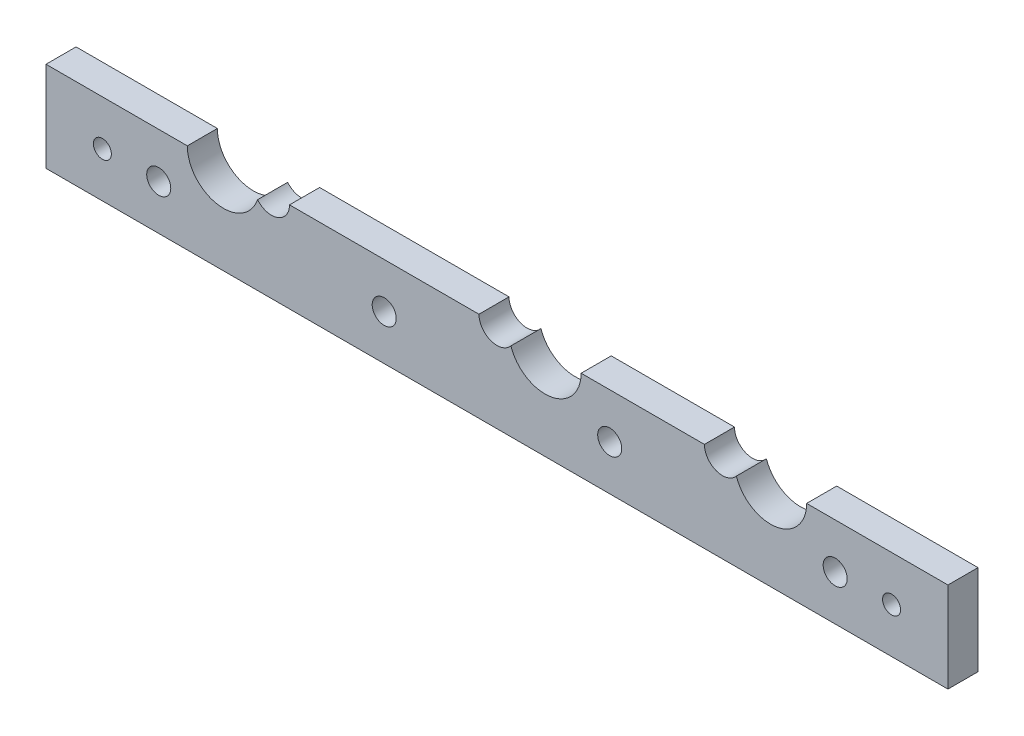
ISO-10303-21;
HEADER;
FILE_DESCRIPTION(('STEP AP214'),'2;1');
FILE_NAME('part.step','',(''),(''),'','','');
FILE_SCHEMA(('AUTOMOTIVE_DESIGN { 1 0 10303 214 1 1 1 1 }'));
ENDSEC;
DATA;
#1=APPLICATION_CONTEXT('core data for automotive mechanical design processes');
#2=APPLICATION_PROTOCOL_DEFINITION('international standard','automotive_design',2000,#1);
#3=PRODUCT_CONTEXT('',#1,'mechanical');
#4=PRODUCT('Part','Part','',(#3));
#5=PRODUCT_RELATED_PRODUCT_CATEGORY('part','',(#4));
#6=PRODUCT_DEFINITION_FORMATION('','',#4);
#7=PRODUCT_DEFINITION_CONTEXT('part definition',#1,'design');
#8=PRODUCT_DEFINITION('design','',#6,#7);
#9=PRODUCT_DEFINITION_SHAPE('','',#8);
#10=(LENGTH_UNIT() NAMED_UNIT(*) SI_UNIT(.MILLI.,.METRE.));
#11=(NAMED_UNIT(*) PLANE_ANGLE_UNIT() SI_UNIT($,.RADIAN.));
#12=(NAMED_UNIT(*) SI_UNIT($,.STERADIAN.) SOLID_ANGLE_UNIT());
#13=UNCERTAINTY_MEASURE_WITH_UNIT(LENGTH_MEASURE(1.E-05),#10,'distance_accuracy_value','');
#14=(GEOMETRIC_REPRESENTATION_CONTEXT(3) GLOBAL_UNCERTAINTY_ASSIGNED_CONTEXT((#13)) GLOBAL_UNIT_ASSIGNED_CONTEXT((#10,
#11,#12)) REPRESENTATION_CONTEXT('',''));
#15=CARTESIAN_POINT('',(0.,0.,0.));
#16=DIRECTION('',(0.,0.,1.));
#17=DIRECTION('',(1.,0.,0.));
#18=AXIS2_PLACEMENT_3D('',#15,#16,#17);
#19=CARTESIAN_POINT('',(-56.8107458055713,18.5530588779456,5.));
#20=DIRECTION('',(1.,0.,0.));
#21=DIRECTION('',(0.,1.,0.));
#22=AXIS2_PLACEMENT_3D('',#19,#20,#21);
#23=PLANE('',#22);
#24=DIRECTION('',(0.,0.,1.));
#25=VECTOR('',#24,1.);
#26=CARTESIAN_POINT('',(-56.8107458055713,3.55305887794556,-5.));
#27=LINE('',#26,#25);
#28=CARTESIAN_POINT('',(-56.8107458055713,3.55305887794556,0.));
#29=VERTEX_POINT('',#28);
#30=CARTESIAN_POINT('',(-56.8107458055713,3.55305887794556,5.));
#31=VERTEX_POINT('',#30);
#32=EDGE_CURVE('E216',#29,#31,#27,.T.);
#33=ORIENTED_EDGE('',*,*,#32,.F.);
#34=DIRECTION('',(0.,-1.,0.));
#35=VECTOR('',#34,1.);
#36=CARTESIAN_POINT('',(-56.8107458055713,18.5530588779456,0.));
#37=LINE('',#36,#35);
#38=CARTESIAN_POINT('',(-56.8107458055713,-11.4469411220544,0.));
#39=VERTEX_POINT('',#38);
#40=EDGE_CURVE('E162',#29,#39,#37,.T.);
#41=ORIENTED_EDGE('',*,*,#40,.T.);
#42=DIRECTION('',(0.,0.,-1.));
#43=VECTOR('',#42,1.);
#44=CARTESIAN_POINT('',(-56.8107458055713,-11.4469411220544,5.));
#45=LINE('',#44,#43);
#46=CARTESIAN_POINT('',(-56.8107458055713,-11.4469411220544,5.));
#47=VERTEX_POINT('',#46);
#48=EDGE_CURVE('E179',#47,#39,#45,.T.);
#49=ORIENTED_EDGE('',*,*,#48,.F.);
#50=DIRECTION('',(0.,-1.,0.));
#51=VECTOR('',#50,1.);
#52=CARTESIAN_POINT('',(-56.8107458055713,18.5530588779456,5.));
#53=LINE('',#52,#51);
#54=EDGE_CURVE('E163',#31,#47,#53,.T.);
#55=ORIENTED_EDGE('',*,*,#54,.F.);
#56=EDGE_LOOP('',(#33,#41,#49,#55));
#57=FACE_BOUND('',#56,.T.);
#58=ADVANCED_FACE('F35',(#57),#23,.F.);
#59=CARTESIAN_POINT('',(93.1892541944287,18.5530588779456,5.));
#60=DIRECTION('',(1.,0.,0.));
#61=DIRECTION('',(0.,0.,-1.));
#62=AXIS2_PLACEMENT_3D('',#59,#60,#61);
#63=PLANE('',#62);
#64=DIRECTION('',(0.,-1.,0.));
#65=VECTOR('',#64,1.);
#66=CARTESIAN_POINT('',(93.1892541944287,18.5530588779456,0.));
#67=LINE('',#66,#65);
#68=CARTESIAN_POINT('',(93.1892541944287,3.55305887794556,0.));
#69=VERTEX_POINT('',#68);
#70=CARTESIAN_POINT('',(93.1892541944287,-11.4469411220544,0.));
#71=VERTEX_POINT('',#70);
#72=EDGE_CURVE('E166',#69,#71,#67,.T.);
#73=ORIENTED_EDGE('',*,*,#72,.F.);
#74=DIRECTION('',(0.,0.,1.));
#75=VECTOR('',#74,1.);
#76=CARTESIAN_POINT('',(93.1892541944287,3.55305887794556,-5.));
#77=LINE('',#76,#75);
#78=CARTESIAN_POINT('',(93.1892541944287,3.55305887794556,5.));
#79=VERTEX_POINT('',#78);
#80=EDGE_CURVE('E224',#69,#79,#77,.T.);
#81=ORIENTED_EDGE('',*,*,#80,.T.);
#82=DIRECTION('',(0.,-1.,0.));
#83=VECTOR('',#82,1.);
#84=CARTESIAN_POINT('',(93.1892541944287,18.5530588779456,5.));
#85=LINE('',#84,#83);
#86=CARTESIAN_POINT('',(93.1892541944287,-11.4469411220544,5.));
#87=VERTEX_POINT('',#86);
#88=EDGE_CURVE('E169',#79,#87,#85,.T.);
#89=ORIENTED_EDGE('',*,*,#88,.T.);
#90=DIRECTION('',(0.,0.,-1.));
#91=VECTOR('',#90,1.);
#92=CARTESIAN_POINT('',(93.1892541944287,-11.4469411220544,5.));
#93=LINE('',#92,#91);
#94=EDGE_CURVE('E171',#87,#71,#93,.T.);
#95=ORIENTED_EDGE('',*,*,#94,.T.);
#96=EDGE_LOOP('',(#73,#81,#89,#95));
#97=FACE_BOUND('',#96,.T.);
#98=ADVANCED_FACE('F272',(#97),#63,.T.);
#99=CARTESIAN_POINT('',(0.,0.,5.));
#100=DIRECTION('',(0.,0.,1.));
#101=DIRECTION('',(1.,0.,0.));
#102=AXIS2_PLACEMENT_3D('',#99,#100,#101);
#103=PLANE('',#102);
#104=CARTESIAN_POINT('',(63.6892541944287,3.55305887794556,5.));
#105=DIRECTION('',(0.,0.,1.));
#106=DIRECTION('',(1.,0.,0.));
#107=AXIS2_PLACEMENT_3D('',#104,#105,#106);
#108=CIRCLE('',#107,6.00000000000001);
#109=CARTESIAN_POINT('',(58.0017541944287,1.64194827151798,5.));
#110=VERTEX_POINT('',#109);
#111=CARTESIAN_POINT('',(69.6892541944287,3.55305887794556,5.));
#112=VERTEX_POINT('',#111);
#113=EDGE_CURVE('E48',#110,#112,#108,.T.);
#114=ORIENTED_EDGE('',*,*,#113,.F.);
#115=CARTESIAN_POINT('',(55.6892541944287,3.55305887794556,5.));
#116=DIRECTION('',(0.,0.,1.));
#117=DIRECTION('',(1.,0.,0.));
#118=AXIS2_PLACEMENT_3D('',#115,#116,#117);
#119=CIRCLE('',#118,3.);
#120=CARTESIAN_POINT('',(52.6892541944287,3.55305887794556,5.));
#121=VERTEX_POINT('',#120);
#122=EDGE_CURVE('E142',#121,#110,#119,.T.);
#123=ORIENTED_EDGE('',*,*,#122,.F.);
#124=DIRECTION('',(-1.,0.,0.));
#125=VECTOR('',#124,1.);
#126=CARTESIAN_POINT('',(93.1892541944287,3.55305887794556,5.));
#127=LINE('',#126,#125);
#128=CARTESIAN_POINT('',(32.1892541944287,3.55305887794556,5.));
#129=VERTEX_POINT('',#128);
#130=EDGE_CURVE('E221',#121,#129,#127,.T.);
#131=ORIENTED_EDGE('',*,*,#130,.T.);
#132=CARTESIAN_POINT('',(26.1892541944287,3.55305887794556,5.));
#133=DIRECTION('',(0.,0.,1.));
#134=DIRECTION('',(1.,0.,0.));
#135=AXIS2_PLACEMENT_3D('',#132,#133,#134);
#136=CIRCLE('',#135,5.99999999999999);
#137=CARTESIAN_POINT('',(20.5017541944287,1.64194827151799,5.));
#138=VERTEX_POINT('',#137);
#139=EDGE_CURVE('E228',#138,#129,#136,.T.);
#140=ORIENTED_EDGE('',*,*,#139,.F.);
#141=CARTESIAN_POINT('',(18.1892541944287,3.55305887794556,5.));
#142=DIRECTION('',(0.,0.,1.));
#143=DIRECTION('',(1.,0.,0.));
#144=AXIS2_PLACEMENT_3D('',#141,#142,#143);
#145=CIRCLE('',#144,3.);
#146=CARTESIAN_POINT('',(15.1892541944287,3.55305887794556,5.));
#147=VERTEX_POINT('',#146);
#148=EDGE_CURVE('E152',#147,#138,#145,.T.);
#149=ORIENTED_EDGE('',*,*,#148,.F.);
#150=CARTESIAN_POINT('',(-16.3107458055713,3.55305887794556,5.));
#151=VERTEX_POINT('',#150);
#152=EDGE_CURVE('E218',#147,#151,#127,.T.);
#153=ORIENTED_EDGE('',*,*,#152,.T.);
#154=CARTESIAN_POINT('',(-19.3107458055713,3.55305887794554,5.));
#155=DIRECTION('',(0.,0.,1.));
#156=DIRECTION('',(1.,0.,0.));
#157=AXIS2_PLACEMENT_3D('',#154,#155,#156);
#158=CIRCLE('',#157,3.);
#159=CARTESIAN_POINT('',(-21.6232458055713,1.64194827151797,5.));
#160=VERTEX_POINT('',#159);
#161=EDGE_CURVE('E154',#160,#151,#158,.T.);
#162=ORIENTED_EDGE('',*,*,#161,.F.);
#163=CARTESIAN_POINT('',(-27.3107458055713,3.55305887794556,5.));
#164=DIRECTION('',(0.,0.,1.));
#165=DIRECTION('',(1.,0.,0.));
#166=AXIS2_PLACEMENT_3D('',#163,#164,#165);
#167=CIRCLE('',#166,6.);
#168=CARTESIAN_POINT('',(-33.3107458055713,3.55305887794556,5.));
#169=VERTEX_POINT('',#168);
#170=EDGE_CURVE('E134',#169,#160,#167,.T.);
#171=ORIENTED_EDGE('',*,*,#170,.F.);
#172=EDGE_CURVE('E210',#169,#31,#127,.T.);
#173=ORIENTED_EDGE('',*,*,#172,.T.);
#174=ORIENTED_EDGE('',*,*,#54,.T.);
#175=DIRECTION('',(1.,0.,0.));
#176=VECTOR('',#175,1.);
#177=CARTESIAN_POINT('',(-56.8107458055713,-11.4469411220544,5.));
#178=LINE('',#177,#176);
#179=EDGE_CURVE('E165',#47,#87,#178,.T.);
#180=ORIENTED_EDGE('',*,*,#179,.T.);
#181=ORIENTED_EDGE('',*,*,#88,.F.);
#182=EDGE_CURVE('E144',#79,#112,#127,.T.);
#183=ORIENTED_EDGE('',*,*,#182,.T.);
#184=EDGE_LOOP('',(#114,#123,#131,#140,#149,#153,#162,#171,#173,#174,#180,#181,#183));
#185=FACE_BOUND('',#184,.T.);
#186=CARTESIAN_POINT('',(36.9392541944287,-3.94694112205444,5.));
#187=DIRECTION('',(0.,0.,1.));
#188=DIRECTION('',(1.,0.,0.));
#189=AXIS2_PLACEMENT_3D('',#186,#187,#188);
#190=CIRCLE('',#189,1.99999999999999);
#191=CARTESIAN_POINT('',(38.9392541944287,-3.94694112205444,5.));
#192=VERTEX_POINT('',#191);
#193=EDGE_CURVE('E186',#192,#192,#190,.T.);
#194=ORIENTED_EDGE('',*,*,#193,.F.);
#195=EDGE_LOOP('',(#194));
#196=FACE_BOUND('',#195,.T.);
#197=CARTESIAN_POINT('',(74.4392541944287,-3.94694112205444,5.));
#198=DIRECTION('',(0.,0.,1.));
#199=DIRECTION('',(1.,0.,0.));
#200=AXIS2_PLACEMENT_3D('',#197,#198,#199);
#201=CIRCLE('',#200,2.);
#202=CARTESIAN_POINT('',(76.4392541944287,-3.94694112205444,5.));
#203=VERTEX_POINT('',#202);
#204=EDGE_CURVE('E190',#203,#203,#201,.T.);
#205=ORIENTED_EDGE('',*,*,#204,.F.);
#206=EDGE_LOOP('',(#205));
#207=FACE_BOUND('',#206,.T.);
#208=CARTESIAN_POINT('',(-0.560745805571264,-3.94694112205445,5.));
#209=DIRECTION('',(0.,0.,1.));
#210=DIRECTION('',(1.,0.,0.));
#211=AXIS2_PLACEMENT_3D('',#208,#209,#210);
#212=CIRCLE('',#211,2.);
#213=CARTESIAN_POINT('',(1.43925419442873,-3.94694112205445,5.));
#214=VERTEX_POINT('',#213);
#215=EDGE_CURVE('E191',#214,#214,#212,.T.);
#216=ORIENTED_EDGE('',*,*,#215,.F.);
#217=EDGE_LOOP('',(#216));
#218=FACE_BOUND('',#217,.T.);
#219=CARTESIAN_POINT('',(-38.0607458055713,-3.94694112205446,5.));
#220=DIRECTION('',(0.,0.,1.));
#221=DIRECTION('',(1.,0.,0.));
#222=AXIS2_PLACEMENT_3D('',#219,#220,#221);
#223=CIRCLE('',#222,1.99999999999999);
#224=CARTESIAN_POINT('',(-36.0607458055713,-3.94694112205446,5.));
#225=VERTEX_POINT('',#224);
#226=EDGE_CURVE('E195',#225,#225,#223,.T.);
#227=ORIENTED_EDGE('',*,*,#226,.F.);
#228=EDGE_LOOP('',(#227));
#229=FACE_BOUND('',#228,.T.);
#230=CARTESIAN_POINT('',(-47.4357458055713,-3.94694112205446,5.));
#231=DIRECTION('',(0.,0.,1.));
#232=DIRECTION('',(1.,0.,0.));
#233=AXIS2_PLACEMENT_3D('',#230,#231,#232);
#234=CIRCLE('',#233,1.49999999999999);
#235=CARTESIAN_POINT('',(-45.9357458055713,-3.94694112205446,5.));
#236=VERTEX_POINT('',#235);
#237=EDGE_CURVE('E199',#236,#236,#234,.T.);
#238=ORIENTED_EDGE('',*,*,#237,.F.);
#239=EDGE_LOOP('',(#238));
#240=FACE_BOUND('',#239,.T.);
#241=CARTESIAN_POINT('',(83.8142541944287,-3.94694112205443,5.));
#242=DIRECTION('',(0.,0.,1.));
#243=DIRECTION('',(1.,0.,0.));
#244=AXIS2_PLACEMENT_3D('',#241,#242,#243);
#245=CIRCLE('',#244,1.49999999999999);
#246=CARTESIAN_POINT('',(85.3142541944287,-3.94694112205443,5.));
#247=VERTEX_POINT('',#246);
#248=EDGE_CURVE('E239',#247,#247,#245,.T.);
#249=ORIENTED_EDGE('',*,*,#248,.F.);
#250=EDGE_LOOP('',(#249));
#251=FACE_BOUND('',#250,.T.);
#252=ADVANCED_FACE('F139',(#185,#196,#207,#218,#229,#240,#251),#103,.T.);
#253=CARTESIAN_POINT('',(0.,0.,0.));
#254=DIRECTION('',(0.,0.,1.));
#255=DIRECTION('',(1.,0.,0.));
#256=AXIS2_PLACEMENT_3D('',#253,#254,#255);
#257=PLANE('',#256);
#258=CARTESIAN_POINT('',(36.9392541944287,-3.94694112205444,0.));
#259=DIRECTION('',(0.,0.,1.));
#260=DIRECTION('',(1.,0.,0.));
#261=AXIS2_PLACEMENT_3D('',#258,#259,#260);
#262=CIRCLE('',#261,1.99999999999999);
#263=CARTESIAN_POINT('',(38.9392541944287,-3.94694112205444,0.));
#264=VERTEX_POINT('',#263);
#265=EDGE_CURVE('E183',#264,#264,#262,.T.);
#266=ORIENTED_EDGE('',*,*,#265,.T.);
#267=EDGE_LOOP('',(#266));
#268=FACE_BOUND('',#267,.T.);
#269=CARTESIAN_POINT('',(74.4392541944287,-3.94694112205444,0.));
#270=DIRECTION('',(0.,0.,1.));
#271=DIRECTION('',(1.,0.,0.));
#272=AXIS2_PLACEMENT_3D('',#269,#270,#271);
#273=CIRCLE('',#272,1.99999999999999);
#274=CARTESIAN_POINT('',(76.4392541944287,-3.94694112205444,0.));
#275=VERTEX_POINT('',#274);
#276=EDGE_CURVE('E262',#275,#275,#273,.T.);
#277=ORIENTED_EDGE('',*,*,#276,.T.);
#278=EDGE_LOOP('',(#277));
#279=FACE_BOUND('',#278,.T.);
#280=CARTESIAN_POINT('',(-0.560745805571264,-3.94694112205445,0.));
#281=DIRECTION('',(0.,0.,1.));
#282=DIRECTION('',(1.,0.,0.));
#283=AXIS2_PLACEMENT_3D('',#280,#281,#282);
#284=CIRCLE('',#283,2.);
#285=CARTESIAN_POINT('',(1.43925419442873,-3.94694112205445,0.));
#286=VERTEX_POINT('',#285);
#287=EDGE_CURVE('E187',#286,#286,#284,.T.);
#288=ORIENTED_EDGE('',*,*,#287,.T.);
#289=EDGE_LOOP('',(#288));
#290=FACE_BOUND('',#289,.T.);
#291=CARTESIAN_POINT('',(-38.0607458055713,-3.94694112205446,0.));
#292=DIRECTION('',(0.,0.,1.));
#293=DIRECTION('',(1.,0.,0.));
#294=AXIS2_PLACEMENT_3D('',#291,#292,#293);
#295=CIRCLE('',#294,1.99999999999999);
#296=CARTESIAN_POINT('',(-36.0607458055713,-3.94694112205446,0.));
#297=VERTEX_POINT('',#296);
#298=EDGE_CURVE('E192',#297,#297,#295,.T.);
#299=ORIENTED_EDGE('',*,*,#298,.T.);
#300=EDGE_LOOP('',(#299));
#301=FACE_BOUND('',#300,.T.);
#302=CARTESIAN_POINT('',(-47.4357458055713,-3.94694112205446,0.));
#303=DIRECTION('',(0.,0.,1.));
#304=DIRECTION('',(1.,0.,0.));
#305=AXIS2_PLACEMENT_3D('',#302,#303,#304);
#306=CIRCLE('',#305,1.49999999999999);
#307=CARTESIAN_POINT('',(-45.9357458055713,-3.94694112205446,0.));
#308=VERTEX_POINT('',#307);
#309=EDGE_CURVE('E196',#308,#308,#306,.T.);
#310=ORIENTED_EDGE('',*,*,#309,.T.);
#311=EDGE_LOOP('',(#310));
#312=FACE_BOUND('',#311,.T.);
#313=CARTESIAN_POINT('',(83.8142541944287,-3.94694112205443,0.));
#314=DIRECTION('',(0.,0.,1.));
#315=DIRECTION('',(1.,0.,0.));
#316=AXIS2_PLACEMENT_3D('',#313,#314,#315);
#317=CIRCLE('',#316,1.49999999999999);
#318=CARTESIAN_POINT('',(85.3142541944287,-3.94694112205443,0.));
#319=VERTEX_POINT('',#318);
#320=EDGE_CURVE('E251',#319,#319,#317,.T.);
#321=ORIENTED_EDGE('',*,*,#320,.T.);
#322=EDGE_LOOP('',(#321));
#323=FACE_BOUND('',#322,.T.);
#324=CARTESIAN_POINT('',(55.6892541944287,3.55305887794556,0.));
#325=DIRECTION('',(0.,0.,1.));
#326=DIRECTION('',(1.,0.,0.));
#327=AXIS2_PLACEMENT_3D('',#324,#325,#326);
#328=CIRCLE('',#327,3.);
#329=CARTESIAN_POINT('',(52.6892541944287,3.55305887794556,0.));
#330=VERTEX_POINT('',#329);
#331=CARTESIAN_POINT('',(58.0017541944287,1.64194827151799,0.));
#332=VERTEX_POINT('',#331);
#333=EDGE_CURVE('E149',#330,#332,#328,.T.);
#334=ORIENTED_EDGE('',*,*,#333,.T.);
#335=CARTESIAN_POINT('',(63.6892541944287,3.55305887794556,0.));
#336=DIRECTION('',(0.,0.,1.));
#337=DIRECTION('',(1.,0.,0.));
#338=AXIS2_PLACEMENT_3D('',#335,#336,#337);
#339=CIRCLE('',#338,6.);
#340=CARTESIAN_POINT('',(69.6892541944287,3.55305887794556,0.));
#341=VERTEX_POINT('',#340);
#342=EDGE_CURVE('E129',#332,#341,#339,.T.);
#343=ORIENTED_EDGE('',*,*,#342,.T.);
#344=DIRECTION('',(-1.,0.,0.));
#345=VECTOR('',#344,1.);
#346=CARTESIAN_POINT('',(0.,3.55305887794556,0.));
#347=LINE('',#346,#345);
#348=EDGE_CURVE('E237',#69,#341,#347,.T.);
#349=ORIENTED_EDGE('',*,*,#348,.F.);
#350=ORIENTED_EDGE('',*,*,#72,.T.);
#351=DIRECTION('',(1.,0.,0.));
#352=VECTOR('',#351,1.);
#353=CARTESIAN_POINT('',(-56.8107458055713,-11.4469411220544,0.));
#354=LINE('',#353,#352);
#355=EDGE_CURVE('E173',#39,#71,#354,.T.);
#356=ORIENTED_EDGE('',*,*,#355,.F.);
#357=ORIENTED_EDGE('',*,*,#40,.F.);
#358=CARTESIAN_POINT('',(-33.3107458055713,3.55305887794556,0.));
#359=VERTEX_POINT('',#358);
#360=EDGE_CURVE('E242',#359,#29,#347,.T.);
#361=ORIENTED_EDGE('',*,*,#360,.F.);
#362=CARTESIAN_POINT('',(-27.3107458055713,3.55305887794556,0.));
#363=DIRECTION('',(0.,0.,1.));
#364=DIRECTION('',(1.,0.,0.));
#365=AXIS2_PLACEMENT_3D('',#362,#363,#364);
#366=CIRCLE('',#365,6.);
#367=CARTESIAN_POINT('',(-21.6232458055713,1.64194827151797,0.));
#368=VERTEX_POINT('',#367);
#369=EDGE_CURVE('E56',#359,#368,#366,.T.);
#370=ORIENTED_EDGE('',*,*,#369,.T.);
#371=CARTESIAN_POINT('',(-19.3107458055713,3.55305887794554,0.));
#372=DIRECTION('',(0.,0.,1.));
#373=DIRECTION('',(1.,0.,0.));
#374=AXIS2_PLACEMENT_3D('',#371,#372,#373);
#375=CIRCLE('',#374,3.);
#376=CARTESIAN_POINT('',(-16.3107458055713,3.55305887794554,0.));
#377=VERTEX_POINT('',#376);
#378=EDGE_CURVE('E150',#368,#377,#375,.T.);
#379=ORIENTED_EDGE('',*,*,#378,.T.);
#380=CARTESIAN_POINT('',(15.1892541944287,3.55305887794556,0.));
#381=VERTEX_POINT('',#380);
#382=EDGE_CURVE('E244',#381,#377,#347,.T.);
#383=ORIENTED_EDGE('',*,*,#382,.F.);
#384=CARTESIAN_POINT('',(18.1892541944287,3.55305887794556,0.));
#385=DIRECTION('',(0.,0.,1.));
#386=DIRECTION('',(1.,0.,0.));
#387=AXIS2_PLACEMENT_3D('',#384,#385,#386);
#388=CIRCLE('',#387,3.);
#389=CARTESIAN_POINT('',(20.5017541944287,1.64194827151799,0.));
#390=VERTEX_POINT('',#389);
#391=EDGE_CURVE('E160',#381,#390,#388,.T.);
#392=ORIENTED_EDGE('',*,*,#391,.T.);
#393=CARTESIAN_POINT('',(26.1892541944287,3.55305887794556,0.));
#394=DIRECTION('',(0.,0.,1.));
#395=DIRECTION('',(1.,0.,0.));
#396=AXIS2_PLACEMENT_3D('',#393,#394,#395);
#397=CIRCLE('',#396,5.99999999999999);
#398=CARTESIAN_POINT('',(32.1892541944287,3.55305887794556,0.));
#399=VERTEX_POINT('',#398);
#400=EDGE_CURVE('E236',#390,#399,#397,.T.);
#401=ORIENTED_EDGE('',*,*,#400,.T.);
#402=EDGE_CURVE('E299',#330,#399,#347,.T.);
#403=ORIENTED_EDGE('',*,*,#402,.F.);
#404=EDGE_LOOP('',(#334,#343,#349,#350,#356,#357,#361,#370,#379,#383,#392,#401,#403));
#405=FACE_BOUND('',#404,.T.);
#406=ADVANCED_FACE('F271',(#268,#279,#290,#301,#312,#323,#405),#257,.F.);
#407=CARTESIAN_POINT('',(18.1892541944287,3.55305887794556,5.));
#408=DIRECTION('',(0.,0.,1.));
#409=DIRECTION('',(1.,0.,0.));
#410=AXIS2_PLACEMENT_3D('',#407,#408,#409);
#411=CYLINDRICAL_SURFACE('',#410,3.);
#412=DIRECTION('',(0.,0.,1.));
#413=VECTOR('',#412,1.);
#414=CARTESIAN_POINT('',(15.1892541944287,3.55305887794556,5.));
#415=LINE('',#414,#413);
#416=EDGE_CURVE('E246',#147,#381,#415,.F.);
#417=ORIENTED_EDGE('',*,*,#416,.F.);
#418=ORIENTED_EDGE('',*,*,#148,.T.);
#419=DIRECTION('',(0.,0.,1.));
#420=VECTOR('',#419,1.);
#421=CARTESIAN_POINT('',(20.5017541944287,1.64194827151799,-7.5));
#422=LINE('',#421,#420);
#423=EDGE_CURVE('E181',#138,#390,#422,.F.);
#424=ORIENTED_EDGE('',*,*,#423,.T.);
#425=ORIENTED_EDGE('',*,*,#391,.F.);
#426=EDGE_LOOP('',(#417,#418,#424,#425));
#427=FACE_BOUND('',#426,.T.);
#428=ADVANCED_FACE('F294',(#427),#411,.F.);
#429=CARTESIAN_POINT('',(55.6892541944287,3.55305887794556,5.));
#430=DIRECTION('',(0.,0.,1.));
#431=DIRECTION('',(1.,0.,0.));
#432=AXIS2_PLACEMENT_3D('',#429,#430,#431);
#433=CYLINDRICAL_SURFACE('',#432,3.);
#434=ORIENTED_EDGE('',*,*,#122,.T.);
#435=DIRECTION('',(0.,0.,1.));
#436=VECTOR('',#435,1.);
#437=CARTESIAN_POINT('',(58.0017541944287,1.64194827151799,-1.375));
#438=LINE('',#437,#436);
#439=EDGE_CURVE('E126',#110,#332,#438,.F.);
#440=ORIENTED_EDGE('',*,*,#439,.T.);
#441=ORIENTED_EDGE('',*,*,#333,.F.);
#442=DIRECTION('',(0.,0.,1.));
#443=VECTOR('',#442,1.);
#444=CARTESIAN_POINT('',(52.6892541944287,3.55305887794556,5.));
#445=LINE('',#444,#443);
#446=EDGE_CURVE('E148',#121,#330,#445,.F.);
#447=ORIENTED_EDGE('',*,*,#446,.F.);
#448=EDGE_LOOP('',(#434,#440,#441,#447));
#449=FACE_BOUND('',#448,.T.);
#450=ADVANCED_FACE('F147',(#449),#433,.F.);
#451=CARTESIAN_POINT('',(-19.3107458055713,3.55305887794554,5.));
#452=DIRECTION('',(0.,0.,1.));
#453=DIRECTION('',(1.,0.,0.));
#454=AXIS2_PLACEMENT_3D('',#451,#452,#453);
#455=CYLINDRICAL_SURFACE('',#454,3.);
#456=ORIENTED_EDGE('',*,*,#378,.F.);
#457=DIRECTION('',(0.,0.,1.));
#458=VECTOR('',#457,1.);
#459=CARTESIAN_POINT('',(-21.6232458055713,1.64194827151797,-1.375));
#460=LINE('',#459,#458);
#461=EDGE_CURVE('E219',#368,#160,#460,.T.);
#462=ORIENTED_EDGE('',*,*,#461,.T.);
#463=ORIENTED_EDGE('',*,*,#161,.T.);
#464=DIRECTION('',(0.,0.,1.));
#465=VECTOR('',#464,1.);
#466=CARTESIAN_POINT('',(-16.3107458055713,3.55305887794556,5.));
#467=LINE('',#466,#465);
#468=EDGE_CURVE('E300',#377,#151,#467,.T.);
#469=ORIENTED_EDGE('',*,*,#468,.F.);
#470=EDGE_LOOP('',(#456,#462,#463,#469));
#471=FACE_BOUND('',#470,.T.);
#472=ADVANCED_FACE('F315',(#471),#455,.F.);
#473=CARTESIAN_POINT('',(26.1892541944287,3.55305887794556,5.));
#474=DIRECTION('',(0.,0.,1.));
#475=DIRECTION('',(1.,0.,0.));
#476=AXIS2_PLACEMENT_3D('',#473,#474,#475);
#477=CYLINDRICAL_SURFACE('',#476,5.99999999999999);
#478=DIRECTION('',(0.,0.,1.));
#479=VECTOR('',#478,1.);
#480=CARTESIAN_POINT('',(32.1892541944287,3.55305887794556,5.));
#481=LINE('',#480,#479);
#482=EDGE_CURVE('E202',#399,#129,#481,.T.);
#483=ORIENTED_EDGE('',*,*,#482,.F.);
#484=ORIENTED_EDGE('',*,*,#400,.F.);
#485=ORIENTED_EDGE('',*,*,#423,.F.);
#486=ORIENTED_EDGE('',*,*,#139,.T.);
#487=EDGE_LOOP('',(#483,#484,#485,#486));
#488=FACE_BOUND('',#487,.T.);
#489=ADVANCED_FACE('F233',(#488),#477,.F.);
#490=CARTESIAN_POINT('',(-56.8107458055713,-11.4469411220544,5.));
#491=DIRECTION('',(0.,1.,0.));
#492=DIRECTION('',(0.,0.,1.));
#493=AXIS2_PLACEMENT_3D('',#490,#491,#492);
#494=PLANE('',#493);
#495=ORIENTED_EDGE('',*,*,#355,.T.);
#496=ORIENTED_EDGE('',*,*,#94,.F.);
#497=ORIENTED_EDGE('',*,*,#179,.F.);
#498=ORIENTED_EDGE('',*,*,#48,.T.);
#499=EDGE_LOOP('',(#495,#496,#497,#498));
#500=FACE_BOUND('',#499,.T.);
#501=ADVANCED_FACE('F322',(#500),#494,.F.);
#502=CARTESIAN_POINT('',(36.9392541944287,-3.94694112205444,5.));
#503=DIRECTION('',(0.,0.,1.));
#504=DIRECTION('',(1.,0.,0.));
#505=AXIS2_PLACEMENT_3D('',#502,#503,#504);
#506=CYLINDRICAL_SURFACE('',#505,1.99999999999999);
#507=ORIENTED_EDGE('',*,*,#193,.T.);
#508=EDGE_LOOP('',(#507));
#509=FACE_BOUND('',#508,.T.);
#510=ORIENTED_EDGE('',*,*,#265,.F.);
#511=EDGE_LOOP('',(#510));
#512=FACE_BOUND('',#511,.T.);
#513=ADVANCED_FACE('F267',(#509,#512),#506,.F.);
#514=CARTESIAN_POINT('',(74.4392541944287,-3.94694112205444,5.));
#515=DIRECTION('',(0.,0.,1.));
#516=DIRECTION('',(1.,0.,0.));
#517=AXIS2_PLACEMENT_3D('',#514,#515,#516);
#518=CYLINDRICAL_SURFACE('',#517,1.99999999999999);
#519=ORIENTED_EDGE('',*,*,#204,.T.);
#520=EDGE_LOOP('',(#519));
#521=FACE_BOUND('',#520,.T.);
#522=ORIENTED_EDGE('',*,*,#276,.F.);
#523=EDGE_LOOP('',(#522));
#524=FACE_BOUND('',#523,.T.);
#525=ADVANCED_FACE('F456',(#521,#524),#518,.F.);
#526=CARTESIAN_POINT('',(-0.560745805571264,-3.94694112205445,5.));
#527=DIRECTION('',(0.,0.,1.));
#528=DIRECTION('',(1.,0.,0.));
#529=AXIS2_PLACEMENT_3D('',#526,#527,#528);
#530=CYLINDRICAL_SURFACE('',#529,2.);
#531=ORIENTED_EDGE('',*,*,#215,.T.);
#532=EDGE_LOOP('',(#531));
#533=FACE_BOUND('',#532,.T.);
#534=ORIENTED_EDGE('',*,*,#287,.F.);
#535=EDGE_LOOP('',(#534));
#536=FACE_BOUND('',#535,.T.);
#537=ADVANCED_FACE('F462',(#533,#536),#530,.F.);
#538=CARTESIAN_POINT('',(-38.0607458055713,-3.94694112205446,5.));
#539=DIRECTION('',(0.,0.,1.));
#540=DIRECTION('',(1.,0.,0.));
#541=AXIS2_PLACEMENT_3D('',#538,#539,#540);
#542=CYLINDRICAL_SURFACE('',#541,1.99999999999999);
#543=ORIENTED_EDGE('',*,*,#226,.T.);
#544=EDGE_LOOP('',(#543));
#545=FACE_BOUND('',#544,.T.);
#546=ORIENTED_EDGE('',*,*,#298,.F.);
#547=EDGE_LOOP('',(#546));
#548=FACE_BOUND('',#547,.T.);
#549=ADVANCED_FACE('F470',(#545,#548),#542,.F.);
#550=CARTESIAN_POINT('',(-47.4357458055713,-3.94694112205446,5.));
#551=DIRECTION('',(0.,0.,1.));
#552=DIRECTION('',(1.,0.,0.));
#553=AXIS2_PLACEMENT_3D('',#550,#551,#552);
#554=CYLINDRICAL_SURFACE('',#553,1.49999999999999);
#555=ORIENTED_EDGE('',*,*,#237,.T.);
#556=EDGE_LOOP('',(#555));
#557=FACE_BOUND('',#556,.T.);
#558=ORIENTED_EDGE('',*,*,#309,.F.);
#559=EDGE_LOOP('',(#558));
#560=FACE_BOUND('',#559,.T.);
#561=ADVANCED_FACE('F288',(#557,#560),#554,.F.);
#562=CARTESIAN_POINT('',(83.8142541944287,-3.94694112205443,5.));
#563=DIRECTION('',(0.,0.,1.));
#564=DIRECTION('',(1.,0.,0.));
#565=AXIS2_PLACEMENT_3D('',#562,#563,#564);
#566=CYLINDRICAL_SURFACE('',#565,1.49999999999999);
#567=ORIENTED_EDGE('',*,*,#248,.T.);
#568=EDGE_LOOP('',(#567));
#569=FACE_BOUND('',#568,.T.);
#570=ORIENTED_EDGE('',*,*,#320,.F.);
#571=EDGE_LOOP('',(#570));
#572=FACE_BOUND('',#571,.T.);
#573=ADVANCED_FACE('F284',(#569,#572),#566,.F.);
#574=CARTESIAN_POINT('',(93.1892541944287,3.55305887794556,-5.));
#575=DIRECTION('',(0.,1.,0.));
#576=DIRECTION('',(0.,0.,1.));
#577=AXIS2_PLACEMENT_3D('',#574,#575,#576);
#578=PLANE('',#577);
#579=ORIENTED_EDGE('',*,*,#446,.T.);
#580=ORIENTED_EDGE('',*,*,#402,.T.);
#581=ORIENTED_EDGE('',*,*,#482,.T.);
#582=ORIENTED_EDGE('',*,*,#130,.F.);
#583=EDGE_LOOP('',(#579,#580,#581,#582));
#584=FACE_BOUND('',#583,.T.);
#585=ADVANCED_FACE('F287',(#584),#578,.T.);
#586=ORIENTED_EDGE('',*,*,#416,.T.);
#587=ORIENTED_EDGE('',*,*,#382,.T.);
#588=ORIENTED_EDGE('',*,*,#468,.T.);
#589=ORIENTED_EDGE('',*,*,#152,.F.);
#590=EDGE_LOOP('',(#586,#587,#588,#589));
#591=FACE_BOUND('',#590,.T.);
#592=ADVANCED_FACE('F309',(#591),#578,.T.);
#593=DIRECTION('',(0.,0.,1.));
#594=VECTOR('',#593,1.);
#595=CARTESIAN_POINT('',(-33.3107458055713,3.55305887794556,5.));
#596=LINE('',#595,#594);
#597=EDGE_CURVE('E42',#359,#169,#596,.T.);
#598=ORIENTED_EDGE('',*,*,#597,.F.);
#599=ORIENTED_EDGE('',*,*,#360,.T.);
#600=ORIENTED_EDGE('',*,*,#32,.T.);
#601=ORIENTED_EDGE('',*,*,#172,.F.);
#602=EDGE_LOOP('',(#598,#599,#600,#601));
#603=FACE_BOUND('',#602,.T.);
#604=ADVANCED_FACE('F214',(#603),#578,.T.);
#605=DIRECTION('',(0.,0.,1.));
#606=VECTOR('',#605,1.);
#607=CARTESIAN_POINT('',(69.6892541944287,3.55305887794556,5.));
#608=LINE('',#607,#606);
#609=EDGE_CURVE('E11',#112,#341,#608,.F.);
#610=ORIENTED_EDGE('',*,*,#609,.F.);
#611=ORIENTED_EDGE('',*,*,#182,.F.);
#612=ORIENTED_EDGE('',*,*,#80,.F.);
#613=ORIENTED_EDGE('',*,*,#348,.T.);
#614=EDGE_LOOP('',(#610,#611,#612,#613));
#615=FACE_BOUND('',#614,.T.);
#616=ADVANCED_FACE('F341',(#615),#578,.T.);
#617=CARTESIAN_POINT('',(-27.3107458055713,3.55305887794556,5.));
#618=DIRECTION('',(0.,0.,1.));
#619=DIRECTION('',(1.,0.,0.));
#620=AXIS2_PLACEMENT_3D('',#617,#618,#619);
#621=CYLINDRICAL_SURFACE('',#620,6.);
#622=ORIENTED_EDGE('',*,*,#369,.F.);
#623=ORIENTED_EDGE('',*,*,#597,.T.);
#624=ORIENTED_EDGE('',*,*,#170,.T.);
#625=ORIENTED_EDGE('',*,*,#461,.F.);
#626=EDGE_LOOP('',(#622,#623,#624,#625));
#627=FACE_BOUND('',#626,.T.);
#628=ADVANCED_FACE('F204',(#627),#621,.F.);
#629=CARTESIAN_POINT('',(63.6892541944287,3.55305887794556,5.));
#630=DIRECTION('',(0.,0.,1.));
#631=DIRECTION('',(1.,0.,0.));
#632=AXIS2_PLACEMENT_3D('',#629,#630,#631);
#633=CYLINDRICAL_SURFACE('',#632,6.);
#634=ORIENTED_EDGE('',*,*,#113,.T.);
#635=ORIENTED_EDGE('',*,*,#609,.T.);
#636=ORIENTED_EDGE('',*,*,#342,.F.);
#637=ORIENTED_EDGE('',*,*,#439,.F.);
#638=EDGE_LOOP('',(#634,#635,#636,#637));
#639=FACE_BOUND('',#638,.T.);
#640=ADVANCED_FACE('F127',(#639),#633,.F.);
#641=CLOSED_SHELL('',(#58,#98,#252,#406,#428,#450,#472,#489,#501,#513,#525,#537,#549,#561,#573,
#585,#592,#604,#616,#628,#640));
#642=MANIFOLD_SOLID_BREP('B2',#641);
#643=ADVANCED_BREP_SHAPE_REPRESENTATION('',(#18,#642),#14);
#644=SHAPE_DEFINITION_REPRESENTATION(#9,#643);
ENDSEC;
END-ISO-10303-21;
